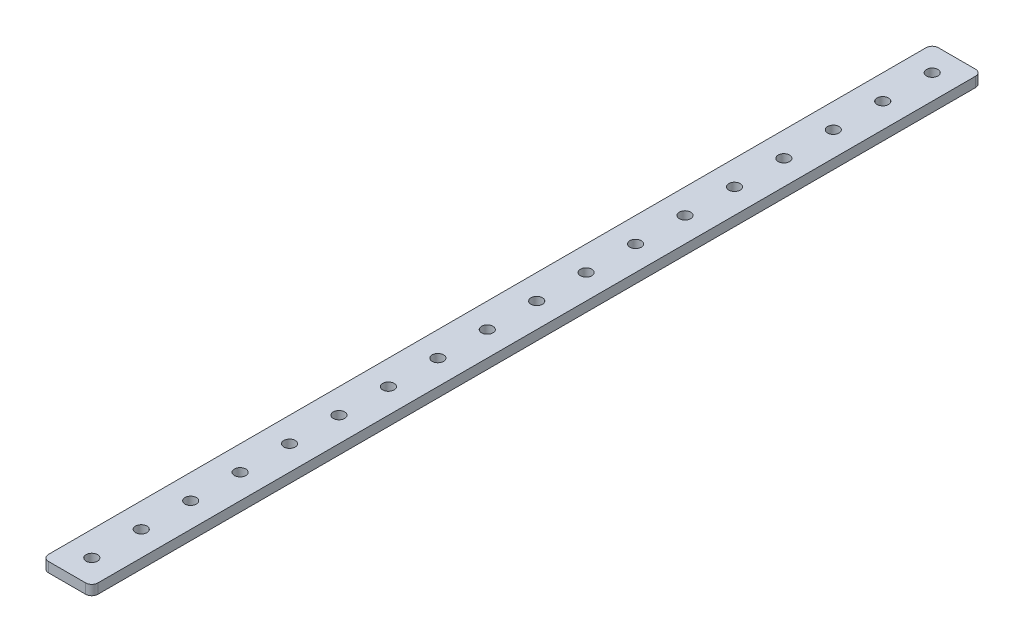
ISO-10303-21;
HEADER;
FILE_DESCRIPTION(('STEP AP214'),'2;1');
FILE_NAME('part.step','',(''),(''),'','','');
FILE_SCHEMA(('AUTOMOTIVE_DESIGN { 1 0 10303 214 1 1 1 1 }'));
ENDSEC;
DATA;
#1=APPLICATION_CONTEXT('core data for automotive mechanical design processes');
#2=APPLICATION_PROTOCOL_DEFINITION('international standard','automotive_design',2000,#1);
#3=PRODUCT_CONTEXT('',#1,'mechanical');
#4=PRODUCT('Part','Part','',(#3));
#5=PRODUCT_RELATED_PRODUCT_CATEGORY('part','',(#4));
#6=PRODUCT_DEFINITION_FORMATION('','',#4);
#7=PRODUCT_DEFINITION_CONTEXT('part definition',#1,'design');
#8=PRODUCT_DEFINITION('design','',#6,#7);
#9=PRODUCT_DEFINITION_SHAPE('','',#8);
#10=(LENGTH_UNIT() NAMED_UNIT(*) SI_UNIT(.MILLI.,.METRE.));
#11=(NAMED_UNIT(*) PLANE_ANGLE_UNIT() SI_UNIT($,.RADIAN.));
#12=(NAMED_UNIT(*) SI_UNIT($,.STERADIAN.) SOLID_ANGLE_UNIT());
#13=UNCERTAINTY_MEASURE_WITH_UNIT(LENGTH_MEASURE(1.E-05),#10,'distance_accuracy_value','');
#14=(GEOMETRIC_REPRESENTATION_CONTEXT(3) GLOBAL_UNCERTAINTY_ASSIGNED_CONTEXT((#13)) GLOBAL_UNIT_ASSIGNED_CONTEXT((#10,
#11,#12)) REPRESENTATION_CONTEXT('',''));
#15=CARTESIAN_POINT('',(0.,0.,0.));
#16=DIRECTION('',(0.,0.,1.));
#17=DIRECTION('',(1.,0.,0.));
#18=AXIS2_PLACEMENT_3D('',#15,#16,#17);
#19=CARTESIAN_POINT('',(-8.,0.,0.));
#20=DIRECTION('',(0.,-1.,0.));
#21=DIRECTION('',(0.,0.,-1.));
#22=AXIS2_PLACEMENT_3D('',#19,#20,#21);
#23=PLANE('',#22);
#24=CARTESIAN_POINT('',(0.,0.,-280.));
#25=DIRECTION('',(0.,-1.,0.));
#26=DIRECTION('',(0.,0.,-1.));
#27=AXIS2_PLACEMENT_3D('',#24,#25,#26);
#28=CIRCLE('',#27,1.85);
#29=CARTESIAN_POINT('',(0.,0.,-281.85));
#30=VERTEX_POINT('',#29);
#31=EDGE_CURVE('E176',#30,#30,#28,.F.);
#32=ORIENTED_EDGE('',*,*,#31,.T.);
#33=EDGE_LOOP('',(#32));
#34=FACE_BOUND('',#33,.T.);
#35=CARTESIAN_POINT('',(0.,0.,-264.));
#36=DIRECTION('',(0.,-1.,0.));
#37=DIRECTION('',(0.,0.,-1.));
#38=AXIS2_PLACEMENT_3D('',#35,#36,#37);
#39=CIRCLE('',#38,1.85);
#40=CARTESIAN_POINT('',(0.,0.,-265.85));
#41=VERTEX_POINT('',#40);
#42=EDGE_CURVE('E179',#41,#41,#39,.F.);
#43=ORIENTED_EDGE('',*,*,#42,.T.);
#44=EDGE_LOOP('',(#43));
#45=FACE_BOUND('',#44,.T.);
#46=CARTESIAN_POINT('',(0.,0.,-248.));
#47=DIRECTION('',(0.,-1.,0.));
#48=DIRECTION('',(0.,0.,-1.));
#49=AXIS2_PLACEMENT_3D('',#46,#47,#48);
#50=CIRCLE('',#49,1.85);
#51=CARTESIAN_POINT('',(0.,0.,-249.85));
#52=VERTEX_POINT('',#51);
#53=EDGE_CURVE('E182',#52,#52,#50,.F.);
#54=ORIENTED_EDGE('',*,*,#53,.T.);
#55=EDGE_LOOP('',(#54));
#56=FACE_BOUND('',#55,.T.);
#57=CARTESIAN_POINT('',(0.,0.,-232.));
#58=DIRECTION('',(0.,-1.,0.));
#59=DIRECTION('',(0.,0.,-1.));
#60=AXIS2_PLACEMENT_3D('',#57,#58,#59);
#61=CIRCLE('',#60,1.85);
#62=CARTESIAN_POINT('',(0.,0.,-233.85));
#63=VERTEX_POINT('',#62);
#64=EDGE_CURVE('E185',#63,#63,#61,.F.);
#65=ORIENTED_EDGE('',*,*,#64,.T.);
#66=EDGE_LOOP('',(#65));
#67=FACE_BOUND('',#66,.T.);
#68=CARTESIAN_POINT('',(0.,0.,-216.));
#69=DIRECTION('',(0.,-1.,0.));
#70=DIRECTION('',(0.,0.,-1.));
#71=AXIS2_PLACEMENT_3D('',#68,#69,#70);
#72=CIRCLE('',#71,1.85);
#73=CARTESIAN_POINT('',(0.,0.,-217.85));
#74=VERTEX_POINT('',#73);
#75=EDGE_CURVE('E188',#74,#74,#72,.F.);
#76=ORIENTED_EDGE('',*,*,#75,.T.);
#77=EDGE_LOOP('',(#76));
#78=FACE_BOUND('',#77,.T.);
#79=CARTESIAN_POINT('',(0.,0.,-200.));
#80=DIRECTION('',(0.,-1.,0.));
#81=DIRECTION('',(0.,0.,-1.));
#82=AXIS2_PLACEMENT_3D('',#79,#80,#81);
#83=CIRCLE('',#82,1.85);
#84=CARTESIAN_POINT('',(0.,0.,-201.85));
#85=VERTEX_POINT('',#84);
#86=EDGE_CURVE('E191',#85,#85,#83,.F.);
#87=ORIENTED_EDGE('',*,*,#86,.T.);
#88=EDGE_LOOP('',(#87));
#89=FACE_BOUND('',#88,.T.);
#90=CARTESIAN_POINT('',(0.,0.,-184.));
#91=DIRECTION('',(0.,-1.,0.));
#92=DIRECTION('',(0.,0.,-1.));
#93=AXIS2_PLACEMENT_3D('',#90,#91,#92);
#94=CIRCLE('',#93,1.85);
#95=CARTESIAN_POINT('',(0.,0.,-185.85));
#96=VERTEX_POINT('',#95);
#97=EDGE_CURVE('E194',#96,#96,#94,.F.);
#98=ORIENTED_EDGE('',*,*,#97,.T.);
#99=EDGE_LOOP('',(#98));
#100=FACE_BOUND('',#99,.T.);
#101=CARTESIAN_POINT('',(0.,0.,-168.));
#102=DIRECTION('',(0.,-1.,0.));
#103=DIRECTION('',(0.,0.,-1.));
#104=AXIS2_PLACEMENT_3D('',#101,#102,#103);
#105=CIRCLE('',#104,1.85);
#106=CARTESIAN_POINT('',(0.,0.,-169.85));
#107=VERTEX_POINT('',#106);
#108=EDGE_CURVE('E197',#107,#107,#105,.F.);
#109=ORIENTED_EDGE('',*,*,#108,.T.);
#110=EDGE_LOOP('',(#109));
#111=FACE_BOUND('',#110,.T.);
#112=CARTESIAN_POINT('',(0.,0.,-152.));
#113=DIRECTION('',(0.,-1.,0.));
#114=DIRECTION('',(0.,0.,-1.));
#115=AXIS2_PLACEMENT_3D('',#112,#113,#114);
#116=CIRCLE('',#115,1.85);
#117=CARTESIAN_POINT('',(0.,0.,-153.85));
#118=VERTEX_POINT('',#117);
#119=EDGE_CURVE('E200',#118,#118,#116,.F.);
#120=ORIENTED_EDGE('',*,*,#119,.T.);
#121=EDGE_LOOP('',(#120));
#122=FACE_BOUND('',#121,.T.);
#123=CARTESIAN_POINT('',(0.,0.,-136.));
#124=DIRECTION('',(0.,-1.,0.));
#125=DIRECTION('',(0.,0.,-1.));
#126=AXIS2_PLACEMENT_3D('',#123,#124,#125);
#127=CIRCLE('',#126,1.85);
#128=CARTESIAN_POINT('',(0.,0.,-137.85));
#129=VERTEX_POINT('',#128);
#130=EDGE_CURVE('E203',#129,#129,#127,.F.);
#131=ORIENTED_EDGE('',*,*,#130,.T.);
#132=EDGE_LOOP('',(#131));
#133=FACE_BOUND('',#132,.T.);
#134=CARTESIAN_POINT('',(0.,0.,-120.));
#135=DIRECTION('',(0.,-1.,0.));
#136=DIRECTION('',(0.,0.,-1.));
#137=AXIS2_PLACEMENT_3D('',#134,#135,#136);
#138=CIRCLE('',#137,1.85);
#139=CARTESIAN_POINT('',(0.,0.,-121.85));
#140=VERTEX_POINT('',#139);
#141=EDGE_CURVE('E206',#140,#140,#138,.F.);
#142=ORIENTED_EDGE('',*,*,#141,.T.);
#143=EDGE_LOOP('',(#142));
#144=FACE_BOUND('',#143,.T.);
#145=CARTESIAN_POINT('',(0.,0.,-104.));
#146=DIRECTION('',(0.,-1.,0.));
#147=DIRECTION('',(0.,0.,-1.));
#148=AXIS2_PLACEMENT_3D('',#145,#146,#147);
#149=CIRCLE('',#148,1.85);
#150=CARTESIAN_POINT('',(0.,0.,-105.85));
#151=VERTEX_POINT('',#150);
#152=EDGE_CURVE('E209',#151,#151,#149,.F.);
#153=ORIENTED_EDGE('',*,*,#152,.T.);
#154=EDGE_LOOP('',(#153));
#155=FACE_BOUND('',#154,.T.);
#156=CARTESIAN_POINT('',(0.,0.,-88.));
#157=DIRECTION('',(0.,-1.,0.));
#158=DIRECTION('',(0.,0.,-1.));
#159=AXIS2_PLACEMENT_3D('',#156,#157,#158);
#160=CIRCLE('',#159,1.85);
#161=CARTESIAN_POINT('',(0.,0.,-89.85));
#162=VERTEX_POINT('',#161);
#163=EDGE_CURVE('E212',#162,#162,#160,.F.);
#164=ORIENTED_EDGE('',*,*,#163,.T.);
#165=EDGE_LOOP('',(#164));
#166=FACE_BOUND('',#165,.T.);
#167=CARTESIAN_POINT('',(0.,0.,-72.));
#168=DIRECTION('',(0.,-1.,0.));
#169=DIRECTION('',(0.,0.,-1.));
#170=AXIS2_PLACEMENT_3D('',#167,#168,#169);
#171=CIRCLE('',#170,1.85);
#172=CARTESIAN_POINT('',(0.,0.,-73.85));
#173=VERTEX_POINT('',#172);
#174=EDGE_CURVE('E215',#173,#173,#171,.F.);
#175=ORIENTED_EDGE('',*,*,#174,.T.);
#176=EDGE_LOOP('',(#175));
#177=FACE_BOUND('',#176,.T.);
#178=CARTESIAN_POINT('',(0.,0.,-56.));
#179=DIRECTION('',(0.,-1.,0.));
#180=DIRECTION('',(0.,0.,-1.));
#181=AXIS2_PLACEMENT_3D('',#178,#179,#180);
#182=CIRCLE('',#181,1.85);
#183=CARTESIAN_POINT('',(0.,0.,-57.85));
#184=VERTEX_POINT('',#183);
#185=EDGE_CURVE('E218',#184,#184,#182,.F.);
#186=ORIENTED_EDGE('',*,*,#185,.T.);
#187=EDGE_LOOP('',(#186));
#188=FACE_BOUND('',#187,.T.);
#189=CARTESIAN_POINT('',(0.,0.,-40.));
#190=DIRECTION('',(0.,-1.,0.));
#191=DIRECTION('',(0.,0.,-1.));
#192=AXIS2_PLACEMENT_3D('',#189,#190,#191);
#193=CIRCLE('',#192,1.85);
#194=CARTESIAN_POINT('',(0.,0.,-41.85));
#195=VERTEX_POINT('',#194);
#196=EDGE_CURVE('E221',#195,#195,#193,.F.);
#197=ORIENTED_EDGE('',*,*,#196,.T.);
#198=EDGE_LOOP('',(#197));
#199=FACE_BOUND('',#198,.T.);
#200=CARTESIAN_POINT('',(0.,0.,-24.));
#201=DIRECTION('',(0.,-1.,0.));
#202=DIRECTION('',(0.,0.,-1.));
#203=AXIS2_PLACEMENT_3D('',#200,#201,#202);
#204=CIRCLE('',#203,1.85);
#205=CARTESIAN_POINT('',(0.,0.,-25.85));
#206=VERTEX_POINT('',#205);
#207=EDGE_CURVE('E224',#206,#206,#204,.F.);
#208=ORIENTED_EDGE('',*,*,#207,.T.);
#209=EDGE_LOOP('',(#208));
#210=FACE_BOUND('',#209,.T.);
#211=CARTESIAN_POINT('',(0.,0.,-8.));
#212=DIRECTION('',(0.,-1.,0.));
#213=DIRECTION('',(0.,0.,-1.));
#214=AXIS2_PLACEMENT_3D('',#211,#212,#213);
#215=CIRCLE('',#214,1.85);
#216=CARTESIAN_POINT('',(0.,0.,-9.85));
#217=VERTEX_POINT('',#216);
#218=EDGE_CURVE('E92',#217,#217,#215,.F.);
#219=ORIENTED_EDGE('',*,*,#218,.T.);
#220=EDGE_LOOP('',(#219));
#221=FACE_BOUND('',#220,.T.);
#222=CARTESIAN_POINT('',(-6.,0.,-286.));
#223=DIRECTION('',(0.,1.,0.));
#224=DIRECTION('',(0.,0.,1.));
#225=AXIS2_PLACEMENT_3D('',#222,#223,#224);
#226=CIRCLE('',#225,2.);
#227=CARTESIAN_POINT('',(-6.,0.,-288.));
#228=VERTEX_POINT('',#227);
#229=CARTESIAN_POINT('',(-8.,0.,-286.));
#230=VERTEX_POINT('',#229);
#231=EDGE_CURVE('E17',#228,#230,#226,.T.);
#232=ORIENTED_EDGE('',*,*,#231,.F.);
#233=DIRECTION('',(1.,0.,0.));
#234=VECTOR('',#233,1.);
#235=CARTESIAN_POINT('',(0.,0.,-288.));
#236=LINE('',#235,#234);
#237=CARTESIAN_POINT('',(6.,0.,-288.));
#238=VERTEX_POINT('',#237);
#239=EDGE_CURVE('E80',#228,#238,#236,.T.);
#240=ORIENTED_EDGE('',*,*,#239,.T.);
#241=CARTESIAN_POINT('',(6.,0.,-286.));
#242=DIRECTION('',(0.,-1.,0.));
#243=DIRECTION('',(0.,0.,-1.));
#244=AXIS2_PLACEMENT_3D('',#241,#242,#243);
#245=CIRCLE('',#244,2.);
#246=CARTESIAN_POINT('',(8.,0.,-286.));
#247=VERTEX_POINT('',#246);
#248=EDGE_CURVE('E95',#247,#238,#245,.F.);
#249=ORIENTED_EDGE('',*,*,#248,.F.);
#250=DIRECTION('',(0.,0.,-1.));
#251=VECTOR('',#250,1.);
#252=CARTESIAN_POINT('',(8.,0.,0.));
#253=LINE('',#252,#251);
#254=CARTESIAN_POINT('',(8.,0.,-2.));
#255=VERTEX_POINT('',#254);
#256=EDGE_CURVE('E104',#255,#247,#253,.T.);
#257=ORIENTED_EDGE('',*,*,#256,.F.);
#258=CARTESIAN_POINT('',(6.,0.,-2.));
#259=DIRECTION('',(0.,1.,0.));
#260=DIRECTION('',(0.,0.,1.));
#261=AXIS2_PLACEMENT_3D('',#258,#259,#260);
#262=CIRCLE('',#261,2.);
#263=CARTESIAN_POINT('',(6.,0.,0.));
#264=VERTEX_POINT('',#263);
#265=EDGE_CURVE('E229',#264,#255,#262,.T.);
#266=ORIENTED_EDGE('',*,*,#265,.F.);
#267=DIRECTION('',(1.,0.,0.));
#268=VECTOR('',#267,1.);
#269=CARTESIAN_POINT('',(0.,0.,0.));
#270=LINE('',#269,#268);
#271=CARTESIAN_POINT('',(-6.,0.,0.));
#272=VERTEX_POINT('',#271);
#273=EDGE_CURVE('E107',#272,#264,#270,.T.);
#274=ORIENTED_EDGE('',*,*,#273,.F.);
#275=CARTESIAN_POINT('',(-6.,0.,-2.));
#276=DIRECTION('',(0.,-1.,0.));
#277=DIRECTION('',(0.,0.,-1.));
#278=AXIS2_PLACEMENT_3D('',#275,#276,#277);
#279=CIRCLE('',#278,2.);
#280=CARTESIAN_POINT('',(-8.,0.,-2.));
#281=VERTEX_POINT('',#280);
#282=EDGE_CURVE('E230',#281,#272,#279,.F.);
#283=ORIENTED_EDGE('',*,*,#282,.F.);
#284=DIRECTION('',(0.,0.,1.));
#285=VECTOR('',#284,1.);
#286=CARTESIAN_POINT('',(-8.,0.,0.));
#287=LINE('',#286,#285);
#288=EDGE_CURVE('E82',#230,#281,#287,.T.);
#289=ORIENTED_EDGE('',*,*,#288,.F.);
#290=EDGE_LOOP('',(#232,#240,#249,#257,#266,#274,#283,#289));
#291=FACE_BOUND('',#290,.T.);
#292=ADVANCED_FACE('F14',(#34,#45,#56,#67,#78,#89,#100,#111,#122,#133,#144,#155,#166,#177,#188,
#199,#210,#221,#291),#23,.T.);
#293=CARTESIAN_POINT('',(-6.,-4.17152000000001,-286.));
#294=DIRECTION('',(0.,1.,0.));
#295=DIRECTION('',(0.,0.,1.));
#296=AXIS2_PLACEMENT_3D('',#293,#294,#295);
#297=CYLINDRICAL_SURFACE('',#296,2.);
#298=DIRECTION('',(0.,1.,0.));
#299=VECTOR('',#298,1.);
#300=CARTESIAN_POINT('',(-8.,3.2,-286.));
#301=LINE('',#300,#299);
#302=CARTESIAN_POINT('',(-8.,3.2,-286.));
#303=VERTEX_POINT('',#302);
#304=EDGE_CURVE('E102',#303,#230,#301,.F.);
#305=ORIENTED_EDGE('',*,*,#304,.F.);
#306=CARTESIAN_POINT('',(-6.,3.2,-286.));
#307=DIRECTION('',(0.,1.,0.));
#308=DIRECTION('',(0.,0.,1.));
#309=AXIS2_PLACEMENT_3D('',#306,#307,#308);
#310=CIRCLE('',#309,2.);
#311=CARTESIAN_POINT('',(-6.,3.2,-288.));
#312=VERTEX_POINT('',#311);
#313=EDGE_CURVE('E89',#312,#303,#310,.T.);
#314=ORIENTED_EDGE('',*,*,#313,.F.);
#315=DIRECTION('',(0.,1.,0.));
#316=VECTOR('',#315,1.);
#317=CARTESIAN_POINT('',(-6.,0.,-288.));
#318=LINE('',#317,#316);
#319=EDGE_CURVE('E86',#312,#228,#318,.F.);
#320=ORIENTED_EDGE('',*,*,#319,.T.);
#321=ORIENTED_EDGE('',*,*,#231,.T.);
#322=EDGE_LOOP('',(#305,#314,#320,#321));
#323=FACE_BOUND('',#322,.T.);
#324=ADVANCED_FACE('F87',(#323),#297,.T.);
#325=CARTESIAN_POINT('',(-8.,3.2,0.));
#326=DIRECTION('',(-1.,0.,0.));
#327=DIRECTION('',(0.,0.,1.));
#328=AXIS2_PLACEMENT_3D('',#325,#326,#327);
#329=PLANE('',#328);
#330=DIRECTION('',(0.,0.,1.));
#331=VECTOR('',#330,1.);
#332=CARTESIAN_POINT('',(-8.,3.2,0.));
#333=LINE('',#332,#331);
#334=CARTESIAN_POINT('',(-8.,3.2,-2.));
#335=VERTEX_POINT('',#334);
#336=EDGE_CURVE('E174',#303,#335,#333,.T.);
#337=ORIENTED_EDGE('',*,*,#336,.F.);
#338=ORIENTED_EDGE('',*,*,#304,.T.);
#339=ORIENTED_EDGE('',*,*,#288,.T.);
#340=DIRECTION('',(0.,-1.,0.));
#341=VECTOR('',#340,1.);
#342=CARTESIAN_POINT('',(-8.,7.37152,-2.));
#343=LINE('',#342,#341);
#344=EDGE_CURVE('E231',#335,#281,#343,.T.);
#345=ORIENTED_EDGE('',*,*,#344,.F.);
#346=EDGE_LOOP('',(#337,#338,#339,#345));
#347=FACE_BOUND('',#346,.T.);
#348=ADVANCED_FACE('F268',(#347),#329,.T.);
#349=CARTESIAN_POINT('',(-6.,7.37152,-2.));
#350=DIRECTION('',(0.,-1.,0.));
#351=DIRECTION('',(0.,0.,-1.));
#352=AXIS2_PLACEMENT_3D('',#349,#350,#351);
#353=CYLINDRICAL_SURFACE('',#352,2.);
#354=ORIENTED_EDGE('',*,*,#344,.T.);
#355=ORIENTED_EDGE('',*,*,#282,.T.);
#356=DIRECTION('',(0.,1.,0.));
#357=VECTOR('',#356,1.);
#358=CARTESIAN_POINT('',(-6.,0.,0.));
#359=LINE('',#358,#357);
#360=CARTESIAN_POINT('',(-6.,3.2,0.));
#361=VERTEX_POINT('',#360);
#362=EDGE_CURVE('E110',#361,#272,#359,.F.);
#363=ORIENTED_EDGE('',*,*,#362,.F.);
#364=CARTESIAN_POINT('',(-6.,3.2,-2.));
#365=DIRECTION('',(0.,-1.,0.));
#366=DIRECTION('',(0.,0.,-1.));
#367=AXIS2_PLACEMENT_3D('',#364,#365,#366);
#368=CIRCLE('',#367,2.);
#369=EDGE_CURVE('E171',#335,#361,#368,.F.);
#370=ORIENTED_EDGE('',*,*,#369,.F.);
#371=EDGE_LOOP('',(#354,#355,#363,#370));
#372=FACE_BOUND('',#371,.T.);
#373=ADVANCED_FACE('F265',(#372),#353,.T.);
#374=CARTESIAN_POINT('',(0.,0.,0.));
#375=DIRECTION('',(0.,0.,1.));
#376=DIRECTION('',(1.,0.,0.));
#377=AXIS2_PLACEMENT_3D('',#374,#375,#376);
#378=PLANE('',#377);
#379=ORIENTED_EDGE('',*,*,#362,.T.);
#380=ORIENTED_EDGE('',*,*,#273,.T.);
#381=DIRECTION('',(0.,1.,0.));
#382=VECTOR('',#381,1.);
#383=CARTESIAN_POINT('',(6.,-4.17152,0.));
#384=LINE('',#383,#382);
#385=CARTESIAN_POINT('',(6.,3.2,0.));
#386=VERTEX_POINT('',#385);
#387=EDGE_CURVE('E109',#386,#264,#384,.F.);
#388=ORIENTED_EDGE('',*,*,#387,.F.);
#389=DIRECTION('',(1.,0.,0.));
#390=VECTOR('',#389,1.);
#391=CARTESIAN_POINT('',(8.,3.2,0.));
#392=LINE('',#391,#390);
#393=EDGE_CURVE('E170',#361,#386,#392,.T.);
#394=ORIENTED_EDGE('',*,*,#393,.F.);
#395=EDGE_LOOP('',(#379,#380,#388,#394));
#396=FACE_BOUND('',#395,.T.);
#397=ADVANCED_FACE('F264',(#396),#378,.T.);
#398=CARTESIAN_POINT('',(6.,-4.17152,-2.));
#399=DIRECTION('',(0.,1.,0.));
#400=DIRECTION('',(0.,0.,1.));
#401=AXIS2_PLACEMENT_3D('',#398,#399,#400);
#402=CYLINDRICAL_SURFACE('',#401,2.);
#403=DIRECTION('',(0.,1.,0.));
#404=VECTOR('',#403,1.);
#405=CARTESIAN_POINT('',(8.,0.,-2.));
#406=LINE('',#405,#404);
#407=CARTESIAN_POINT('',(8.,3.2,-2.));
#408=VERTEX_POINT('',#407);
#409=EDGE_CURVE('E106',#408,#255,#406,.F.);
#410=ORIENTED_EDGE('',*,*,#409,.F.);
#411=CARTESIAN_POINT('',(6.,3.2,-2.));
#412=DIRECTION('',(0.,1.,0.));
#413=DIRECTION('',(0.,0.,1.));
#414=AXIS2_PLACEMENT_3D('',#411,#412,#413);
#415=CIRCLE('',#414,2.);
#416=EDGE_CURVE('E167',#386,#408,#415,.T.);
#417=ORIENTED_EDGE('',*,*,#416,.F.);
#418=ORIENTED_EDGE('',*,*,#387,.T.);
#419=ORIENTED_EDGE('',*,*,#265,.T.);
#420=EDGE_LOOP('',(#410,#417,#418,#419));
#421=FACE_BOUND('',#420,.T.);
#422=ADVANCED_FACE('F261',(#421),#402,.T.);
#423=CARTESIAN_POINT('',(8.,0.,0.));
#424=DIRECTION('',(1.,0.,0.));
#425=DIRECTION('',(0.,0.,-1.));
#426=AXIS2_PLACEMENT_3D('',#423,#424,#425);
#427=PLANE('',#426);
#428=ORIENTED_EDGE('',*,*,#256,.T.);
#429=DIRECTION('',(0.,-1.,0.));
#430=VECTOR('',#429,1.);
#431=CARTESIAN_POINT('',(8.,7.37152,-286.));
#432=LINE('',#431,#430);
#433=CARTESIAN_POINT('',(8.,3.2,-286.));
#434=VERTEX_POINT('',#433);
#435=EDGE_CURVE('E98',#434,#247,#432,.T.);
#436=ORIENTED_EDGE('',*,*,#435,.F.);
#437=DIRECTION('',(0.,0.,1.));
#438=VECTOR('',#437,1.);
#439=CARTESIAN_POINT('',(8.,3.2,0.));
#440=LINE('',#439,#438);
#441=EDGE_CURVE('E166',#408,#434,#440,.F.);
#442=ORIENTED_EDGE('',*,*,#441,.F.);
#443=ORIENTED_EDGE('',*,*,#409,.T.);
#444=EDGE_LOOP('',(#428,#436,#442,#443));
#445=FACE_BOUND('',#444,.T.);
#446=ADVANCED_FACE('F256',(#445),#427,.T.);
#447=CARTESIAN_POINT('',(6.,7.37152,-286.));
#448=DIRECTION('',(0.,-1.,0.));
#449=DIRECTION('',(0.,0.,-1.));
#450=AXIS2_PLACEMENT_3D('',#447,#448,#449);
#451=CYLINDRICAL_SURFACE('',#450,2.);
#452=ORIENTED_EDGE('',*,*,#435,.T.);
#453=ORIENTED_EDGE('',*,*,#248,.T.);
#454=DIRECTION('',(0.,1.,0.));
#455=VECTOR('',#454,1.);
#456=CARTESIAN_POINT('',(6.,0.,-288.));
#457=LINE('',#456,#455);
#458=CARTESIAN_POINT('',(6.,3.2,-288.));
#459=VERTEX_POINT('',#458);
#460=EDGE_CURVE('E32',#238,#459,#457,.T.);
#461=ORIENTED_EDGE('',*,*,#460,.T.);
#462=CARTESIAN_POINT('',(6.,3.2,-286.));
#463=DIRECTION('',(0.,-1.,0.));
#464=DIRECTION('',(0.,0.,-1.));
#465=AXIS2_PLACEMENT_3D('',#462,#463,#464);
#466=CIRCLE('',#465,2.);
#467=EDGE_CURVE('E163',#434,#459,#466,.F.);
#468=ORIENTED_EDGE('',*,*,#467,.F.);
#469=EDGE_LOOP('',(#452,#453,#461,#468));
#470=FACE_BOUND('',#469,.T.);
#471=ADVANCED_FACE('F254',(#470),#451,.T.);
#472=CARTESIAN_POINT('',(0.,0.,-288.));
#473=DIRECTION('',(0.,0.,1.));
#474=DIRECTION('',(1.,0.,0.));
#475=AXIS2_PLACEMENT_3D('',#472,#473,#474);
#476=PLANE('',#475);
#477=DIRECTION('',(1.,0.,0.));
#478=VECTOR('',#477,1.);
#479=CARTESIAN_POINT('',(8.,3.2,-288.));
#480=LINE('',#479,#478);
#481=EDGE_CURVE('E162',#459,#312,#480,.F.);
#482=ORIENTED_EDGE('',*,*,#481,.F.);
#483=ORIENTED_EDGE('',*,*,#460,.F.);
#484=ORIENTED_EDGE('',*,*,#239,.F.);
#485=ORIENTED_EDGE('',*,*,#319,.F.);
#486=EDGE_LOOP('',(#482,#483,#484,#485));
#487=FACE_BOUND('',#486,.T.);
#488=ADVANCED_FACE('F94',(#487),#476,.F.);
#489=CARTESIAN_POINT('',(0.,3.2,-8.));
#490=DIRECTION('',(0.,-1.,0.));
#491=DIRECTION('',(0.,0.,-1.));
#492=AXIS2_PLACEMENT_3D('',#489,#490,#491);
#493=CYLINDRICAL_SURFACE('',#492,1.85);
#494=CARTESIAN_POINT('',(0.,3.2,-8.));
#495=DIRECTION('',(0.,-1.,0.));
#496=DIRECTION('',(0.,0.,-1.));
#497=AXIS2_PLACEMENT_3D('',#494,#495,#496);
#498=CIRCLE('',#497,1.85);
#499=CARTESIAN_POINT('',(0.,3.2,-9.85));
#500=VERTEX_POINT('',#499);
#501=EDGE_CURVE('E159',#500,#500,#498,.T.);
#502=ORIENTED_EDGE('',*,*,#501,.F.);
#503=EDGE_LOOP('',(#502));
#504=FACE_BOUND('',#503,.T.);
#505=ORIENTED_EDGE('',*,*,#218,.F.);
#506=EDGE_LOOP('',(#505));
#507=FACE_BOUND('',#506,.T.);
#508=ADVANCED_FACE('F351',(#504,#507),#493,.F.);
#509=CARTESIAN_POINT('',(0.,3.2,-24.));
#510=DIRECTION('',(0.,-1.,0.));
#511=DIRECTION('',(0.,0.,-1.));
#512=AXIS2_PLACEMENT_3D('',#509,#510,#511);
#513=CYLINDRICAL_SURFACE('',#512,1.85);
#514=CARTESIAN_POINT('',(0.,3.2,-24.));
#515=DIRECTION('',(0.,-1.,0.));
#516=DIRECTION('',(0.,0.,-1.));
#517=AXIS2_PLACEMENT_3D('',#514,#515,#516);
#518=CIRCLE('',#517,1.85);
#519=CARTESIAN_POINT('',(0.,3.2,-25.85));
#520=VERTEX_POINT('',#519);
#521=EDGE_CURVE('E156',#520,#520,#518,.T.);
#522=ORIENTED_EDGE('',*,*,#521,.F.);
#523=EDGE_LOOP('',(#522));
#524=FACE_BOUND('',#523,.T.);
#525=ORIENTED_EDGE('',*,*,#207,.F.);
#526=EDGE_LOOP('',(#525));
#527=FACE_BOUND('',#526,.T.);
#528=ADVANCED_FACE('F347',(#524,#527),#513,.F.);
#529=CARTESIAN_POINT('',(0.,3.2,-40.));
#530=DIRECTION('',(0.,-1.,0.));
#531=DIRECTION('',(0.,0.,-1.));
#532=AXIS2_PLACEMENT_3D('',#529,#530,#531);
#533=CYLINDRICAL_SURFACE('',#532,1.85);
#534=CARTESIAN_POINT('',(0.,3.2,-40.));
#535=DIRECTION('',(0.,-1.,0.));
#536=DIRECTION('',(0.,0.,-1.));
#537=AXIS2_PLACEMENT_3D('',#534,#535,#536);
#538=CIRCLE('',#537,1.85);
#539=CARTESIAN_POINT('',(0.,3.2,-41.85));
#540=VERTEX_POINT('',#539);
#541=EDGE_CURVE('E153',#540,#540,#538,.T.);
#542=ORIENTED_EDGE('',*,*,#541,.F.);
#543=EDGE_LOOP('',(#542));
#544=FACE_BOUND('',#543,.T.);
#545=ORIENTED_EDGE('',*,*,#196,.F.);
#546=EDGE_LOOP('',(#545));
#547=FACE_BOUND('',#546,.T.);
#548=ADVANCED_FACE('F343',(#544,#547),#533,.F.);
#549=CARTESIAN_POINT('',(0.,3.2,-56.));
#550=DIRECTION('',(0.,-1.,0.));
#551=DIRECTION('',(0.,0.,-1.));
#552=AXIS2_PLACEMENT_3D('',#549,#550,#551);
#553=CYLINDRICAL_SURFACE('',#552,1.85);
#554=CARTESIAN_POINT('',(0.,3.2,-56.));
#555=DIRECTION('',(0.,-1.,0.));
#556=DIRECTION('',(0.,0.,-1.));
#557=AXIS2_PLACEMENT_3D('',#554,#555,#556);
#558=CIRCLE('',#557,1.85);
#559=CARTESIAN_POINT('',(0.,3.2,-57.85));
#560=VERTEX_POINT('',#559);
#561=EDGE_CURVE('E150',#560,#560,#558,.T.);
#562=ORIENTED_EDGE('',*,*,#561,.F.);
#563=EDGE_LOOP('',(#562));
#564=FACE_BOUND('',#563,.T.);
#565=ORIENTED_EDGE('',*,*,#185,.F.);
#566=EDGE_LOOP('',(#565));
#567=FACE_BOUND('',#566,.T.);
#568=ADVANCED_FACE('F339',(#564,#567),#553,.F.);
#569=CARTESIAN_POINT('',(0.,3.2,-72.));
#570=DIRECTION('',(0.,-1.,0.));
#571=DIRECTION('',(0.,0.,-1.));
#572=AXIS2_PLACEMENT_3D('',#569,#570,#571);
#573=CYLINDRICAL_SURFACE('',#572,1.85);
#574=CARTESIAN_POINT('',(0.,3.2,-72.));
#575=DIRECTION('',(0.,-1.,0.));
#576=DIRECTION('',(0.,0.,-1.));
#577=AXIS2_PLACEMENT_3D('',#574,#575,#576);
#578=CIRCLE('',#577,1.85);
#579=CARTESIAN_POINT('',(0.,3.2,-73.85));
#580=VERTEX_POINT('',#579);
#581=EDGE_CURVE('E147',#580,#580,#578,.T.);
#582=ORIENTED_EDGE('',*,*,#581,.F.);
#583=EDGE_LOOP('',(#582));
#584=FACE_BOUND('',#583,.T.);
#585=ORIENTED_EDGE('',*,*,#174,.F.);
#586=EDGE_LOOP('',(#585));
#587=FACE_BOUND('',#586,.T.);
#588=ADVANCED_FACE('F335',(#584,#587),#573,.F.);
#589=CARTESIAN_POINT('',(0.,3.2,-88.));
#590=DIRECTION('',(0.,-1.,0.));
#591=DIRECTION('',(0.,0.,-1.));
#592=AXIS2_PLACEMENT_3D('',#589,#590,#591);
#593=CYLINDRICAL_SURFACE('',#592,1.85);
#594=CARTESIAN_POINT('',(0.,3.2,-88.));
#595=DIRECTION('',(0.,-1.,0.));
#596=DIRECTION('',(0.,0.,-1.));
#597=AXIS2_PLACEMENT_3D('',#594,#595,#596);
#598=CIRCLE('',#597,1.85);
#599=CARTESIAN_POINT('',(0.,3.2,-89.85));
#600=VERTEX_POINT('',#599);
#601=EDGE_CURVE('E144',#600,#600,#598,.T.);
#602=ORIENTED_EDGE('',*,*,#601,.F.);
#603=EDGE_LOOP('',(#602));
#604=FACE_BOUND('',#603,.T.);
#605=ORIENTED_EDGE('',*,*,#163,.F.);
#606=EDGE_LOOP('',(#605));
#607=FACE_BOUND('',#606,.T.);
#608=ADVANCED_FACE('F331',(#604,#607),#593,.F.);
#609=CARTESIAN_POINT('',(0.,3.2,-104.));
#610=DIRECTION('',(0.,-1.,0.));
#611=DIRECTION('',(0.,0.,-1.));
#612=AXIS2_PLACEMENT_3D('',#609,#610,#611);
#613=CYLINDRICAL_SURFACE('',#612,1.85);
#614=CARTESIAN_POINT('',(0.,3.2,-104.));
#615=DIRECTION('',(0.,-1.,0.));
#616=DIRECTION('',(0.,0.,-1.));
#617=AXIS2_PLACEMENT_3D('',#614,#615,#616);
#618=CIRCLE('',#617,1.85);
#619=CARTESIAN_POINT('',(0.,3.2,-105.85));
#620=VERTEX_POINT('',#619);
#621=EDGE_CURVE('E141',#620,#620,#618,.T.);
#622=ORIENTED_EDGE('',*,*,#621,.F.);
#623=EDGE_LOOP('',(#622));
#624=FACE_BOUND('',#623,.T.);
#625=ORIENTED_EDGE('',*,*,#152,.F.);
#626=EDGE_LOOP('',(#625));
#627=FACE_BOUND('',#626,.T.);
#628=ADVANCED_FACE('F327',(#624,#627),#613,.F.);
#629=CARTESIAN_POINT('',(0.,3.2,-120.));
#630=DIRECTION('',(0.,-1.,0.));
#631=DIRECTION('',(0.,0.,-1.));
#632=AXIS2_PLACEMENT_3D('',#629,#630,#631);
#633=CYLINDRICAL_SURFACE('',#632,1.85);
#634=CARTESIAN_POINT('',(0.,3.2,-120.));
#635=DIRECTION('',(0.,-1.,0.));
#636=DIRECTION('',(0.,0.,-1.));
#637=AXIS2_PLACEMENT_3D('',#634,#635,#636);
#638=CIRCLE('',#637,1.85);
#639=CARTESIAN_POINT('',(0.,3.2,-121.85));
#640=VERTEX_POINT('',#639);
#641=EDGE_CURVE('E138',#640,#640,#638,.T.);
#642=ORIENTED_EDGE('',*,*,#641,.F.);
#643=EDGE_LOOP('',(#642));
#644=FACE_BOUND('',#643,.T.);
#645=ORIENTED_EDGE('',*,*,#141,.F.);
#646=EDGE_LOOP('',(#645));
#647=FACE_BOUND('',#646,.T.);
#648=ADVANCED_FACE('F323',(#644,#647),#633,.F.);
#649=CARTESIAN_POINT('',(0.,3.2,-136.));
#650=DIRECTION('',(0.,-1.,0.));
#651=DIRECTION('',(0.,0.,-1.));
#652=AXIS2_PLACEMENT_3D('',#649,#650,#651);
#653=CYLINDRICAL_SURFACE('',#652,1.85);
#654=CARTESIAN_POINT('',(0.,3.2,-136.));
#655=DIRECTION('',(0.,-1.,0.));
#656=DIRECTION('',(0.,0.,-1.));
#657=AXIS2_PLACEMENT_3D('',#654,#655,#656);
#658=CIRCLE('',#657,1.85);
#659=CARTESIAN_POINT('',(0.,3.2,-137.85));
#660=VERTEX_POINT('',#659);
#661=EDGE_CURVE('E135',#660,#660,#658,.T.);
#662=ORIENTED_EDGE('',*,*,#661,.F.);
#663=EDGE_LOOP('',(#662));
#664=FACE_BOUND('',#663,.T.);
#665=ORIENTED_EDGE('',*,*,#130,.F.);
#666=EDGE_LOOP('',(#665));
#667=FACE_BOUND('',#666,.T.);
#668=ADVANCED_FACE('F319',(#664,#667),#653,.F.);
#669=CARTESIAN_POINT('',(0.,3.2,-152.));
#670=DIRECTION('',(0.,-1.,0.));
#671=DIRECTION('',(0.,0.,-1.));
#672=AXIS2_PLACEMENT_3D('',#669,#670,#671);
#673=CYLINDRICAL_SURFACE('',#672,1.85);
#674=CARTESIAN_POINT('',(0.,3.2,-152.));
#675=DIRECTION('',(0.,-1.,0.));
#676=DIRECTION('',(0.,0.,-1.));
#677=AXIS2_PLACEMENT_3D('',#674,#675,#676);
#678=CIRCLE('',#677,1.85);
#679=CARTESIAN_POINT('',(0.,3.2,-153.85));
#680=VERTEX_POINT('',#679);
#681=EDGE_CURVE('E132',#680,#680,#678,.T.);
#682=ORIENTED_EDGE('',*,*,#681,.F.);
#683=EDGE_LOOP('',(#682));
#684=FACE_BOUND('',#683,.T.);
#685=ORIENTED_EDGE('',*,*,#119,.F.);
#686=EDGE_LOOP('',(#685));
#687=FACE_BOUND('',#686,.T.);
#688=ADVANCED_FACE('F315',(#684,#687),#673,.F.);
#689=CARTESIAN_POINT('',(0.,3.2,-168.));
#690=DIRECTION('',(0.,-1.,0.));
#691=DIRECTION('',(0.,0.,-1.));
#692=AXIS2_PLACEMENT_3D('',#689,#690,#691);
#693=CYLINDRICAL_SURFACE('',#692,1.85);
#694=CARTESIAN_POINT('',(0.,3.2,-168.));
#695=DIRECTION('',(0.,-1.,0.));
#696=DIRECTION('',(0.,0.,-1.));
#697=AXIS2_PLACEMENT_3D('',#694,#695,#696);
#698=CIRCLE('',#697,1.85);
#699=CARTESIAN_POINT('',(0.,3.2,-169.85));
#700=VERTEX_POINT('',#699);
#701=EDGE_CURVE('E129',#700,#700,#698,.T.);
#702=ORIENTED_EDGE('',*,*,#701,.F.);
#703=EDGE_LOOP('',(#702));
#704=FACE_BOUND('',#703,.T.);
#705=ORIENTED_EDGE('',*,*,#108,.F.);
#706=EDGE_LOOP('',(#705));
#707=FACE_BOUND('',#706,.T.);
#708=ADVANCED_FACE('F311',(#704,#707),#693,.F.);
#709=CARTESIAN_POINT('',(0.,3.2,-184.));
#710=DIRECTION('',(0.,-1.,0.));
#711=DIRECTION('',(0.,0.,-1.));
#712=AXIS2_PLACEMENT_3D('',#709,#710,#711);
#713=CYLINDRICAL_SURFACE('',#712,1.85);
#714=CARTESIAN_POINT('',(0.,3.2,-184.));
#715=DIRECTION('',(0.,-1.,0.));
#716=DIRECTION('',(0.,0.,-1.));
#717=AXIS2_PLACEMENT_3D('',#714,#715,#716);
#718=CIRCLE('',#717,1.85);
#719=CARTESIAN_POINT('',(0.,3.2,-185.85));
#720=VERTEX_POINT('',#719);
#721=EDGE_CURVE('E126',#720,#720,#718,.T.);
#722=ORIENTED_EDGE('',*,*,#721,.F.);
#723=EDGE_LOOP('',(#722));
#724=FACE_BOUND('',#723,.T.);
#725=ORIENTED_EDGE('',*,*,#97,.F.);
#726=EDGE_LOOP('',(#725));
#727=FACE_BOUND('',#726,.T.);
#728=ADVANCED_FACE('F307',(#724,#727),#713,.F.);
#729=CARTESIAN_POINT('',(0.,3.2,-200.));
#730=DIRECTION('',(0.,-1.,0.));
#731=DIRECTION('',(0.,0.,-1.));
#732=AXIS2_PLACEMENT_3D('',#729,#730,#731);
#733=CYLINDRICAL_SURFACE('',#732,1.85);
#734=CARTESIAN_POINT('',(0.,3.2,-200.));
#735=DIRECTION('',(0.,-1.,0.));
#736=DIRECTION('',(0.,0.,-1.));
#737=AXIS2_PLACEMENT_3D('',#734,#735,#736);
#738=CIRCLE('',#737,1.85);
#739=CARTESIAN_POINT('',(0.,3.2,-201.85));
#740=VERTEX_POINT('',#739);
#741=EDGE_CURVE('E123',#740,#740,#738,.T.);
#742=ORIENTED_EDGE('',*,*,#741,.F.);
#743=EDGE_LOOP('',(#742));
#744=FACE_BOUND('',#743,.T.);
#745=ORIENTED_EDGE('',*,*,#86,.F.);
#746=EDGE_LOOP('',(#745));
#747=FACE_BOUND('',#746,.T.);
#748=ADVANCED_FACE('F303',(#744,#747),#733,.F.);
#749=CARTESIAN_POINT('',(0.,3.2,-216.));
#750=DIRECTION('',(0.,-1.,0.));
#751=DIRECTION('',(0.,0.,-1.));
#752=AXIS2_PLACEMENT_3D('',#749,#750,#751);
#753=CYLINDRICAL_SURFACE('',#752,1.85);
#754=CARTESIAN_POINT('',(0.,3.2,-216.));
#755=DIRECTION('',(0.,-1.,0.));
#756=DIRECTION('',(0.,0.,-1.));
#757=AXIS2_PLACEMENT_3D('',#754,#755,#756);
#758=CIRCLE('',#757,1.85);
#759=CARTESIAN_POINT('',(0.,3.2,-217.85));
#760=VERTEX_POINT('',#759);
#761=EDGE_CURVE('E120',#760,#760,#758,.T.);
#762=ORIENTED_EDGE('',*,*,#761,.F.);
#763=EDGE_LOOP('',(#762));
#764=FACE_BOUND('',#763,.T.);
#765=ORIENTED_EDGE('',*,*,#75,.F.);
#766=EDGE_LOOP('',(#765));
#767=FACE_BOUND('',#766,.T.);
#768=ADVANCED_FACE('F299',(#764,#767),#753,.F.);
#769=CARTESIAN_POINT('',(0.,3.2,-232.));
#770=DIRECTION('',(0.,-1.,0.));
#771=DIRECTION('',(0.,0.,-1.));
#772=AXIS2_PLACEMENT_3D('',#769,#770,#771);
#773=CYLINDRICAL_SURFACE('',#772,1.85);
#774=CARTESIAN_POINT('',(0.,3.2,-232.));
#775=DIRECTION('',(0.,-1.,0.));
#776=DIRECTION('',(0.,0.,-1.));
#777=AXIS2_PLACEMENT_3D('',#774,#775,#776);
#778=CIRCLE('',#777,1.85);
#779=CARTESIAN_POINT('',(0.,3.2,-233.85));
#780=VERTEX_POINT('',#779);
#781=EDGE_CURVE('E117',#780,#780,#778,.T.);
#782=ORIENTED_EDGE('',*,*,#781,.F.);
#783=EDGE_LOOP('',(#782));
#784=FACE_BOUND('',#783,.T.);
#785=ORIENTED_EDGE('',*,*,#64,.F.);
#786=EDGE_LOOP('',(#785));
#787=FACE_BOUND('',#786,.T.);
#788=ADVANCED_FACE('F295',(#784,#787),#773,.F.);
#789=CARTESIAN_POINT('',(0.,3.2,-248.));
#790=DIRECTION('',(0.,-1.,0.));
#791=DIRECTION('',(0.,0.,-1.));
#792=AXIS2_PLACEMENT_3D('',#789,#790,#791);
#793=CYLINDRICAL_SURFACE('',#792,1.85);
#794=CARTESIAN_POINT('',(0.,3.2,-248.));
#795=DIRECTION('',(0.,-1.,0.));
#796=DIRECTION('',(0.,0.,-1.));
#797=AXIS2_PLACEMENT_3D('',#794,#795,#796);
#798=CIRCLE('',#797,1.85);
#799=CARTESIAN_POINT('',(0.,3.2,-249.85));
#800=VERTEX_POINT('',#799);
#801=EDGE_CURVE('E114',#800,#800,#798,.T.);
#802=ORIENTED_EDGE('',*,*,#801,.F.);
#803=EDGE_LOOP('',(#802));
#804=FACE_BOUND('',#803,.T.);
#805=ORIENTED_EDGE('',*,*,#53,.F.);
#806=EDGE_LOOP('',(#805));
#807=FACE_BOUND('',#806,.T.);
#808=ADVANCED_FACE('F291',(#804,#807),#793,.F.);
#809=CARTESIAN_POINT('',(0.,3.2,-264.));
#810=DIRECTION('',(0.,-1.,0.));
#811=DIRECTION('',(0.,0.,-1.));
#812=AXIS2_PLACEMENT_3D('',#809,#810,#811);
#813=CYLINDRICAL_SURFACE('',#812,1.85);
#814=CARTESIAN_POINT('',(0.,3.2,-264.));
#815=DIRECTION('',(0.,-1.,0.));
#816=DIRECTION('',(0.,0.,-1.));
#817=AXIS2_PLACEMENT_3D('',#814,#815,#816);
#818=CIRCLE('',#817,1.85);
#819=CARTESIAN_POINT('',(0.,3.2,-265.85));
#820=VERTEX_POINT('',#819);
#821=EDGE_CURVE('E23',#820,#820,#818,.T.);
#822=ORIENTED_EDGE('',*,*,#821,.F.);
#823=EDGE_LOOP('',(#822));
#824=FACE_BOUND('',#823,.T.);
#825=ORIENTED_EDGE('',*,*,#42,.F.);
#826=EDGE_LOOP('',(#825));
#827=FACE_BOUND('',#826,.T.);
#828=ADVANCED_FACE('F284',(#824,#827),#813,.F.);
#829=CARTESIAN_POINT('',(0.,3.2,-280.));
#830=DIRECTION('',(0.,-1.,0.));
#831=DIRECTION('',(0.,0.,-1.));
#832=AXIS2_PLACEMENT_3D('',#829,#830,#831);
#833=CYLINDRICAL_SURFACE('',#832,1.85);
#834=CARTESIAN_POINT('',(0.,3.2,-280.));
#835=DIRECTION('',(0.,-1.,0.));
#836=DIRECTION('',(0.,0.,-1.));
#837=AXIS2_PLACEMENT_3D('',#834,#835,#836);
#838=CIRCLE('',#837,1.85);
#839=CARTESIAN_POINT('',(0.,3.2,-281.85));
#840=VERTEX_POINT('',#839);
#841=EDGE_CURVE('E9',#840,#840,#838,.T.);
#842=ORIENTED_EDGE('',*,*,#841,.F.);
#843=EDGE_LOOP('',(#842));
#844=FACE_BOUND('',#843,.T.);
#845=ORIENTED_EDGE('',*,*,#31,.F.);
#846=EDGE_LOOP('',(#845));
#847=FACE_BOUND('',#846,.T.);
#848=ADVANCED_FACE('F278',(#844,#847),#833,.F.);
#849=CARTESIAN_POINT('',(8.,3.2,0.));
#850=DIRECTION('',(0.,1.,0.));
#851=DIRECTION('',(0.,0.,1.));
#852=AXIS2_PLACEMENT_3D('',#849,#850,#851);
#853=PLANE('',#852);
#854=ORIENTED_EDGE('',*,*,#841,.T.);
#855=EDGE_LOOP('',(#854));
#856=FACE_BOUND('',#855,.T.);
#857=ORIENTED_EDGE('',*,*,#821,.T.);
#858=EDGE_LOOP('',(#857));
#859=FACE_BOUND('',#858,.T.);
#860=ORIENTED_EDGE('',*,*,#801,.T.);
#861=EDGE_LOOP('',(#860));
#862=FACE_BOUND('',#861,.T.);
#863=ORIENTED_EDGE('',*,*,#781,.T.);
#864=EDGE_LOOP('',(#863));
#865=FACE_BOUND('',#864,.T.);
#866=ORIENTED_EDGE('',*,*,#761,.T.);
#867=EDGE_LOOP('',(#866));
#868=FACE_BOUND('',#867,.T.);
#869=ORIENTED_EDGE('',*,*,#741,.T.);
#870=EDGE_LOOP('',(#869));
#871=FACE_BOUND('',#870,.T.);
#872=ORIENTED_EDGE('',*,*,#721,.T.);
#873=EDGE_LOOP('',(#872));
#874=FACE_BOUND('',#873,.T.);
#875=ORIENTED_EDGE('',*,*,#701,.T.);
#876=EDGE_LOOP('',(#875));
#877=FACE_BOUND('',#876,.T.);
#878=ORIENTED_EDGE('',*,*,#681,.T.);
#879=EDGE_LOOP('',(#878));
#880=FACE_BOUND('',#879,.T.);
#881=ORIENTED_EDGE('',*,*,#661,.T.);
#882=EDGE_LOOP('',(#881));
#883=FACE_BOUND('',#882,.T.);
#884=ORIENTED_EDGE('',*,*,#641,.T.);
#885=EDGE_LOOP('',(#884));
#886=FACE_BOUND('',#885,.T.);
#887=ORIENTED_EDGE('',*,*,#621,.T.);
#888=EDGE_LOOP('',(#887));
#889=FACE_BOUND('',#888,.T.);
#890=ORIENTED_EDGE('',*,*,#601,.T.);
#891=EDGE_LOOP('',(#890));
#892=FACE_BOUND('',#891,.T.);
#893=ORIENTED_EDGE('',*,*,#581,.T.);
#894=EDGE_LOOP('',(#893));
#895=FACE_BOUND('',#894,.T.);
#896=ORIENTED_EDGE('',*,*,#561,.T.);
#897=EDGE_LOOP('',(#896));
#898=FACE_BOUND('',#897,.T.);
#899=ORIENTED_EDGE('',*,*,#541,.T.);
#900=EDGE_LOOP('',(#899));
#901=FACE_BOUND('',#900,.T.);
#902=ORIENTED_EDGE('',*,*,#521,.T.);
#903=EDGE_LOOP('',(#902));
#904=FACE_BOUND('',#903,.T.);
#905=ORIENTED_EDGE('',*,*,#501,.T.);
#906=EDGE_LOOP('',(#905));
#907=FACE_BOUND('',#906,.T.);
#908=ORIENTED_EDGE('',*,*,#467,.T.);
#909=ORIENTED_EDGE('',*,*,#481,.T.);
#910=ORIENTED_EDGE('',*,*,#313,.T.);
#911=ORIENTED_EDGE('',*,*,#336,.T.);
#912=ORIENTED_EDGE('',*,*,#369,.T.);
#913=ORIENTED_EDGE('',*,*,#393,.T.);
#914=ORIENTED_EDGE('',*,*,#416,.T.);
#915=ORIENTED_EDGE('',*,*,#441,.T.);
#916=EDGE_LOOP('',(#908,#909,#910,#911,#912,#913,#914,#915));
#917=FACE_BOUND('',#916,.T.);
#918=ADVANCED_FACE('F252',(#856,#859,#862,#865,#868,#871,#874,#877,#880,#883,#886,#889,#892,
#895,#898,#901,#904,#907,#917),#853,.T.);
#919=CLOSED_SHELL('',(#292,#324,#348,#373,#397,#422,#446,#471,#488,#508,#528,#548,#568,#588,
#608,#628,#648,#668,#688,#708,#728,#748,#768,#788,#808,#828,#848,#918));
#920=MANIFOLD_SOLID_BREP('B1',#919);
#921=ADVANCED_BREP_SHAPE_REPRESENTATION('',(#18,#920),#14);
#922=SHAPE_DEFINITION_REPRESENTATION(#9,#921);
ENDSEC;
END-ISO-10303-21;
